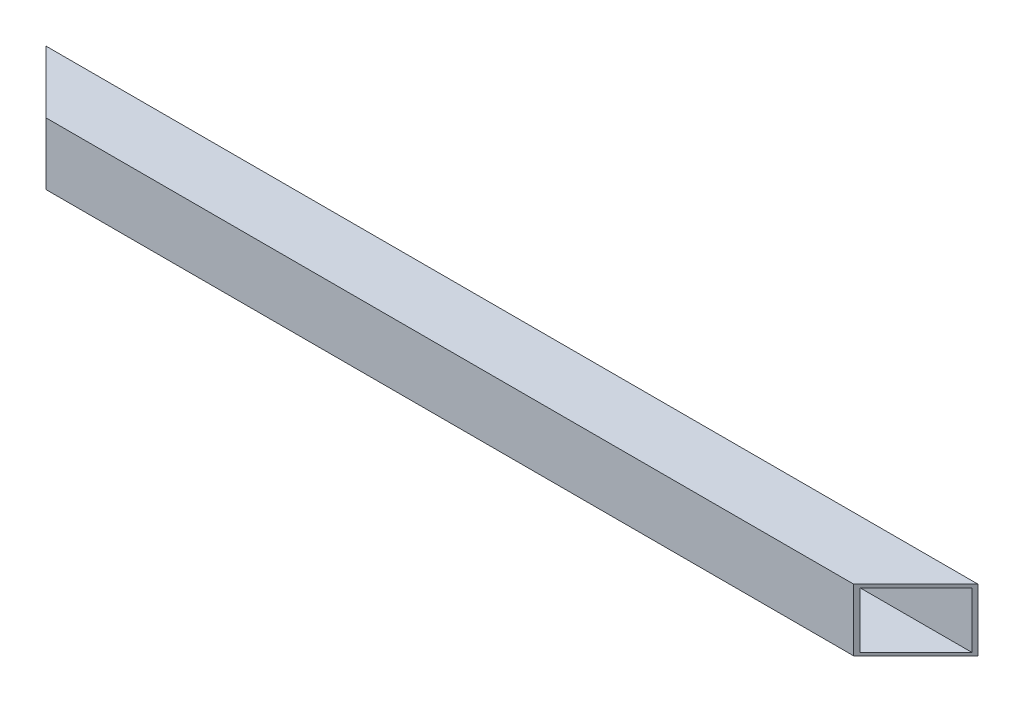
ISO-10303-21;
HEADER;
FILE_DESCRIPTION(('STEP AP214'),'2;1');
FILE_NAME('part.step','',(''),(''),'','','');
FILE_SCHEMA(('AUTOMOTIVE_DESIGN { 1 0 10303 214 1 1 1 1 }'));
ENDSEC;
DATA;
#1=APPLICATION_CONTEXT('core data for automotive mechanical design processes');
#2=APPLICATION_PROTOCOL_DEFINITION('international standard','automotive_design',2000,#1);
#3=PRODUCT_CONTEXT('',#1,'mechanical');
#4=PRODUCT('Part','Part','',(#3));
#5=PRODUCT_RELATED_PRODUCT_CATEGORY('part','',(#4));
#6=PRODUCT_DEFINITION_FORMATION('','',#4);
#7=PRODUCT_DEFINITION_CONTEXT('part definition',#1,'design');
#8=PRODUCT_DEFINITION('design','',#6,#7);
#9=PRODUCT_DEFINITION_SHAPE('','',#8);
#10=(LENGTH_UNIT() NAMED_UNIT(*) SI_UNIT(.MILLI.,.METRE.));
#11=(NAMED_UNIT(*) PLANE_ANGLE_UNIT() SI_UNIT($,.RADIAN.));
#12=(NAMED_UNIT(*) SI_UNIT($,.STERADIAN.) SOLID_ANGLE_UNIT());
#13=UNCERTAINTY_MEASURE_WITH_UNIT(LENGTH_MEASURE(1.E-05),#10,'distance_accuracy_value','');
#14=(GEOMETRIC_REPRESENTATION_CONTEXT(3) GLOBAL_UNCERTAINTY_ASSIGNED_CONTEXT((#13)) GLOBAL_UNIT_ASSIGNED_CONTEXT((#10,
#11,#12)) REPRESENTATION_CONTEXT('',''));
#15=CARTESIAN_POINT('',(0.,0.,0.));
#16=DIRECTION('',(0.,0.,1.));
#17=DIRECTION('',(1.,0.,0.));
#18=AXIS2_PLACEMENT_3D('',#15,#16,#17);
#19=CARTESIAN_POINT('',(600.,-20.,-20.));
#20=DIRECTION('',(0.,0.,1.));
#21=DIRECTION('',(0.,-1.,0.));
#22=AXIS2_PLACEMENT_3D('',#19,#20,#21);
#23=PLANE('',#22);
#24=DIRECTION('',(0.,1.,0.));
#25=VECTOR('',#24,1.);
#26=CARTESIAN_POINT('',(0.,-20.,-20.));
#27=LINE('',#26,#25);
#28=CARTESIAN_POINT('',(0.,-20.,-20.));
#29=VERTEX_POINT('',#28);
#30=CARTESIAN_POINT('',(0.,20.,-20.));
#31=VERTEX_POINT('',#30);
#32=EDGE_CURVE('E115',#29,#31,#27,.T.);
#33=ORIENTED_EDGE('',*,*,#32,.T.);
#34=DIRECTION('',(-1.,0.,0.));
#35=VECTOR('',#34,1.);
#36=CARTESIAN_POINT('',(600.,20.,-20.));
#37=LINE('',#36,#35);
#38=CARTESIAN_POINT('',(600.,20.,-20.));
#39=VERTEX_POINT('',#38);
#40=EDGE_CURVE('E114',#39,#31,#37,.T.);
#41=ORIENTED_EDGE('',*,*,#40,.F.);
#42=DIRECTION('',(0.,1.,0.));
#43=VECTOR('',#42,1.);
#44=CARTESIAN_POINT('',(600.,-20.,-20.));
#45=LINE('',#44,#43);
#46=CARTESIAN_POINT('',(600.,-20.,-20.));
#47=VERTEX_POINT('',#46);
#48=EDGE_CURVE('E96',#47,#39,#45,.T.);
#49=ORIENTED_EDGE('',*,*,#48,.F.);
#50=DIRECTION('',(-1.,0.,0.));
#51=VECTOR('',#50,1.);
#52=CARTESIAN_POINT('',(600.,-20.,-20.));
#53=LINE('',#52,#51);
#54=EDGE_CURVE('E104',#47,#29,#53,.T.);
#55=ORIENTED_EDGE('',*,*,#54,.T.);
#56=EDGE_LOOP('',(#33,#41,#49,#55));
#57=FACE_BOUND('',#56,.T.);
#58=ADVANCED_FACE('F32',(#57),#23,.F.);
#59=CARTESIAN_POINT('',(600.,20.,20.));
#60=DIRECTION('',(0.,-1.,0.));
#61=DIRECTION('',(0.,0.,-1.));
#62=AXIS2_PLACEMENT_3D('',#59,#60,#61);
#63=PLANE('',#62);
#64=DIRECTION('',(-1.,0.,0.));
#65=VECTOR('',#64,1.);
#66=CARTESIAN_POINT('',(600.,20.,20.));
#67=LINE('',#66,#65);
#68=CARTESIAN_POINT('',(560.,20.,20.));
#69=VERTEX_POINT('',#68);
#70=CARTESIAN_POINT('',(40.,20.,20.));
#71=VERTEX_POINT('',#70);
#72=EDGE_CURVE('E123',#69,#71,#67,.T.);
#73=ORIENTED_EDGE('',*,*,#72,.F.);
#74=DIRECTION('',(-0.707106781186547,0.,0.707106781186548));
#75=VECTOR('',#74,1.);
#76=CARTESIAN_POINT('',(560.,20.,20.));
#77=LINE('',#76,#75);
#78=EDGE_CURVE('E100',#39,#69,#77,.T.);
#79=ORIENTED_EDGE('',*,*,#78,.F.);
#80=ORIENTED_EDGE('',*,*,#40,.T.);
#81=DIRECTION('',(-0.707106781186548,0.,-0.707106781186547));
#82=VECTOR('',#81,1.);
#83=CARTESIAN_POINT('',(40.,20.,20.));
#84=LINE('',#83,#82);
#85=EDGE_CURVE('E165',#71,#31,#84,.T.);
#86=ORIENTED_EDGE('',*,*,#85,.F.);
#87=EDGE_LOOP('',(#73,#79,#80,#86));
#88=FACE_BOUND('',#87,.T.);
#89=ADVANCED_FACE('F179',(#88),#63,.F.);
#90=CARTESIAN_POINT('',(600.,-20.,20.));
#91=DIRECTION('',(0.,0.,-1.));
#92=DIRECTION('',(-1.,0.,0.));
#93=AXIS2_PLACEMENT_3D('',#90,#91,#92);
#94=PLANE('',#93);
#95=DIRECTION('',(-1.,0.,0.));
#96=VECTOR('',#95,1.);
#97=CARTESIAN_POINT('',(600.,-20.,20.));
#98=LINE('',#97,#96);
#99=CARTESIAN_POINT('',(560.,-20.,20.));
#100=VERTEX_POINT('',#99);
#101=CARTESIAN_POINT('',(40.,-20.,20.));
#102=VERTEX_POINT('',#101);
#103=EDGE_CURVE('E110',#100,#102,#98,.T.);
#104=ORIENTED_EDGE('',*,*,#103,.F.);
#105=DIRECTION('',(0.,1.,0.));
#106=VECTOR('',#105,1.);
#107=CARTESIAN_POINT('',(560.,-20.,20.));
#108=LINE('',#107,#106);
#109=EDGE_CURVE('E46',#100,#69,#108,.T.);
#110=ORIENTED_EDGE('',*,*,#109,.T.);
#111=ORIENTED_EDGE('',*,*,#72,.T.);
#112=DIRECTION('',(0.,1.,0.));
#113=VECTOR('',#112,1.);
#114=CARTESIAN_POINT('',(40.,-20.,20.));
#115=LINE('',#114,#113);
#116=EDGE_CURVE('E161',#102,#71,#115,.T.);
#117=ORIENTED_EDGE('',*,*,#116,.F.);
#118=EDGE_LOOP('',(#104,#110,#111,#117));
#119=FACE_BOUND('',#118,.T.);
#120=ADVANCED_FACE('F176',(#119),#94,.F.);
#121=CARTESIAN_POINT('',(600.,-20.,20.));
#122=DIRECTION('',(0.,1.,0.));
#123=DIRECTION('',(0.,0.,1.));
#124=AXIS2_PLACEMENT_3D('',#121,#122,#123);
#125=PLANE('',#124);
#126=ORIENTED_EDGE('',*,*,#54,.F.);
#127=DIRECTION('',(-0.707106781186547,0.,0.707106781186548));
#128=VECTOR('',#127,1.);
#129=CARTESIAN_POINT('',(560.,-20.,20.));
#130=LINE('',#129,#128);
#131=EDGE_CURVE('E92',#47,#100,#130,.T.);
#132=ORIENTED_EDGE('',*,*,#131,.T.);
#133=ORIENTED_EDGE('',*,*,#103,.T.);
#134=DIRECTION('',(-0.707106781186548,0.,-0.707106781186547));
#135=VECTOR('',#134,1.);
#136=CARTESIAN_POINT('',(40.,-20.,20.));
#137=LINE('',#136,#135);
#138=EDGE_CURVE('E107',#102,#29,#137,.T.);
#139=ORIENTED_EDGE('',*,*,#138,.T.);
#140=EDGE_LOOP('',(#126,#132,#133,#139));
#141=FACE_BOUND('',#140,.T.);
#142=ADVANCED_FACE('F105',(#141),#125,.F.);
#143=CARTESIAN_POINT('',(600.,-18.,-18.));
#144=DIRECTION('',(0.,0.,1.));
#145=DIRECTION('',(1.,0.,0.));
#146=AXIS2_PLACEMENT_3D('',#143,#144,#145);
#147=PLANE('',#146);
#148=DIRECTION('',(0.,-1.,0.));
#149=VECTOR('',#148,1.);
#150=CARTESIAN_POINT('',(598.,-18.,-18.));
#151=LINE('',#150,#149);
#152=CARTESIAN_POINT('',(598.,18.,-18.));
#153=VERTEX_POINT('',#152);
#154=CARTESIAN_POINT('',(598.,-18.,-18.));
#155=VERTEX_POINT('',#154);
#156=EDGE_CURVE('E53',#153,#155,#151,.T.);
#157=ORIENTED_EDGE('',*,*,#156,.F.);
#158=DIRECTION('',(-1.,0.,0.));
#159=VECTOR('',#158,1.);
#160=CARTESIAN_POINT('',(600.,18.,-18.));
#161=LINE('',#160,#159);
#162=CARTESIAN_POINT('',(2.00000000000006,18.,-18.));
#163=VERTEX_POINT('',#162);
#164=EDGE_CURVE('E117',#153,#163,#161,.T.);
#165=ORIENTED_EDGE('',*,*,#164,.T.);
#166=DIRECTION('',(0.,1.,0.));
#167=VECTOR('',#166,1.);
#168=CARTESIAN_POINT('',(2.,-18.,-18.));
#169=LINE('',#168,#167);
#170=CARTESIAN_POINT('',(2.00000000000006,-18.,-18.));
#171=VERTEX_POINT('',#170);
#172=EDGE_CURVE('E134',#171,#163,#169,.T.);
#173=ORIENTED_EDGE('',*,*,#172,.F.);
#174=DIRECTION('',(-1.,0.,0.));
#175=VECTOR('',#174,1.);
#176=CARTESIAN_POINT('',(600.,-18.,-18.));
#177=LINE('',#176,#175);
#178=EDGE_CURVE('E143',#155,#171,#177,.T.);
#179=ORIENTED_EDGE('',*,*,#178,.F.);
#180=EDGE_LOOP('',(#157,#165,#173,#179));
#181=FACE_BOUND('',#180,.T.);
#182=ADVANCED_FACE('F142',(#181),#147,.T.);
#183=CARTESIAN_POINT('',(600.,18.,18.));
#184=DIRECTION('',(0.,-1.,0.));
#185=DIRECTION('',(0.,0.,-1.));
#186=AXIS2_PLACEMENT_3D('',#183,#184,#185);
#187=PLANE('',#186);
#188=DIRECTION('',(0.707106781186547,0.,-0.707106781186548));
#189=VECTOR('',#188,1.);
#190=CARTESIAN_POINT('',(581.,18.,-0.99999999999998));
#191=LINE('',#190,#189);
#192=CARTESIAN_POINT('',(562.,18.,18.));
#193=VERTEX_POINT('',#192);
#194=EDGE_CURVE('E157',#193,#153,#191,.T.);
#195=ORIENTED_EDGE('',*,*,#194,.F.);
#196=DIRECTION('',(-1.,0.,0.));
#197=VECTOR('',#196,1.);
#198=CARTESIAN_POINT('',(600.,18.,18.));
#199=LINE('',#198,#197);
#200=CARTESIAN_POINT('',(38.,18.,18.));
#201=VERTEX_POINT('',#200);
#202=EDGE_CURVE('E152',#193,#201,#199,.T.);
#203=ORIENTED_EDGE('',*,*,#202,.T.);
#204=DIRECTION('',(0.707106781186548,0.,0.707106781186547));
#205=VECTOR('',#204,1.);
#206=CARTESIAN_POINT('',(319.,18.,299.));
#207=LINE('',#206,#205);
#208=EDGE_CURVE('E145',#163,#201,#207,.T.);
#209=ORIENTED_EDGE('',*,*,#208,.F.);
#210=ORIENTED_EDGE('',*,*,#164,.F.);
#211=EDGE_LOOP('',(#195,#203,#209,#210));
#212=FACE_BOUND('',#211,.T.);
#213=ADVANCED_FACE('F156',(#212),#187,.T.);
#214=CARTESIAN_POINT('',(600.,-18.,18.));
#215=DIRECTION('',(0.,0.,-1.));
#216=DIRECTION('',(-1.,0.,0.));
#217=AXIS2_PLACEMENT_3D('',#214,#215,#216);
#218=PLANE('',#217);
#219=DIRECTION('',(0.,1.,0.));
#220=VECTOR('',#219,1.);
#221=CARTESIAN_POINT('',(562.,-18.,18.));
#222=LINE('',#221,#220);
#223=CARTESIAN_POINT('',(562.,-18.,18.));
#224=VERTEX_POINT('',#223);
#225=EDGE_CURVE('E170',#224,#193,#222,.T.);
#226=ORIENTED_EDGE('',*,*,#225,.F.);
#227=DIRECTION('',(-1.,0.,0.));
#228=VECTOR('',#227,1.);
#229=CARTESIAN_POINT('',(600.,-18.,18.));
#230=LINE('',#229,#228);
#231=CARTESIAN_POINT('',(38.,-18.,18.));
#232=VERTEX_POINT('',#231);
#233=EDGE_CURVE('E147',#224,#232,#230,.T.);
#234=ORIENTED_EDGE('',*,*,#233,.T.);
#235=DIRECTION('',(0.,-1.,0.));
#236=VECTOR('',#235,1.);
#237=CARTESIAN_POINT('',(38.,-18.,18.));
#238=LINE('',#237,#236);
#239=EDGE_CURVE('E137',#201,#232,#238,.T.);
#240=ORIENTED_EDGE('',*,*,#239,.F.);
#241=ORIENTED_EDGE('',*,*,#202,.F.);
#242=EDGE_LOOP('',(#226,#234,#240,#241));
#243=FACE_BOUND('',#242,.T.);
#244=ADVANCED_FACE('F160',(#243),#218,.T.);
#245=CARTESIAN_POINT('',(600.,-18.,18.));
#246=DIRECTION('',(0.,1.,0.));
#247=DIRECTION('',(0.,0.,1.));
#248=AXIS2_PLACEMENT_3D('',#245,#246,#247);
#249=PLANE('',#248);
#250=DIRECTION('',(-0.707106781186547,0.,0.707106781186548));
#251=VECTOR('',#250,1.);
#252=CARTESIAN_POINT('',(581.,-18.,-0.99999999999998));
#253=LINE('',#252,#251);
#254=EDGE_CURVE('E11',#155,#224,#253,.T.);
#255=ORIENTED_EDGE('',*,*,#254,.F.);
#256=ORIENTED_EDGE('',*,*,#178,.T.);
#257=DIRECTION('',(-0.707106781186548,0.,-0.707106781186547));
#258=VECTOR('',#257,1.);
#259=CARTESIAN_POINT('',(319.,-18.,299.));
#260=LINE('',#259,#258);
#261=EDGE_CURVE('E39',#232,#171,#260,.T.);
#262=ORIENTED_EDGE('',*,*,#261,.F.);
#263=ORIENTED_EDGE('',*,*,#233,.F.);
#264=EDGE_LOOP('',(#255,#256,#262,#263));
#265=FACE_BOUND('',#264,.T.);
#266=ADVANCED_FACE('F181',(#265),#249,.T.);
#267=CARTESIAN_POINT('',(40.,-20.,20.));
#268=DIRECTION('',(0.707106781186547,0.,-0.707106781186548));
#269=DIRECTION('',(-0.707106781186548,0.,-0.707106781186547));
#270=AXIS2_PLACEMENT_3D('',#267,#268,#269);
#271=PLANE('',#270);
#272=ORIENTED_EDGE('',*,*,#172,.T.);
#273=ORIENTED_EDGE('',*,*,#208,.T.);
#274=ORIENTED_EDGE('',*,*,#239,.T.);
#275=ORIENTED_EDGE('',*,*,#261,.T.);
#276=EDGE_LOOP('',(#272,#273,#274,#275));
#277=FACE_BOUND('',#276,.T.);
#278=ORIENTED_EDGE('',*,*,#85,.T.);
#279=ORIENTED_EDGE('',*,*,#32,.F.);
#280=ORIENTED_EDGE('',*,*,#138,.F.);
#281=ORIENTED_EDGE('',*,*,#116,.T.);
#282=EDGE_LOOP('',(#278,#279,#280,#281));
#283=FACE_BOUND('',#282,.T.);
#284=ADVANCED_FACE('F131',(#277,#283),#271,.F.);
#285=CARTESIAN_POINT('',(560.,-20.,20.));
#286=DIRECTION('',(-0.707106781186548,0.,-0.707106781186547));
#287=DIRECTION('',(-0.707106781186547,0.,0.707106781186548));
#288=AXIS2_PLACEMENT_3D('',#285,#286,#287);
#289=PLANE('',#288);
#290=ORIENTED_EDGE('',*,*,#156,.T.);
#291=ORIENTED_EDGE('',*,*,#254,.T.);
#292=ORIENTED_EDGE('',*,*,#225,.T.);
#293=ORIENTED_EDGE('',*,*,#194,.T.);
#294=EDGE_LOOP('',(#290,#291,#292,#293));
#295=FACE_BOUND('',#294,.T.);
#296=ORIENTED_EDGE('',*,*,#78,.T.);
#297=ORIENTED_EDGE('',*,*,#109,.F.);
#298=ORIENTED_EDGE('',*,*,#131,.F.);
#299=ORIENTED_EDGE('',*,*,#48,.T.);
#300=EDGE_LOOP('',(#296,#297,#298,#299));
#301=FACE_BOUND('',#300,.T.);
#302=ADVANCED_FACE('F94',(#295,#301),#289,.F.);
#303=CLOSED_SHELL('',(#58,#89,#120,#142,#182,#213,#244,#266,#284,#302));
#304=MANIFOLD_SOLID_BREP('B2',#303);
#305=ADVANCED_BREP_SHAPE_REPRESENTATION('',(#18,#304),#14);
#306=SHAPE_DEFINITION_REPRESENTATION(#9,#305);
ENDSEC;
END-ISO-10303-21;
